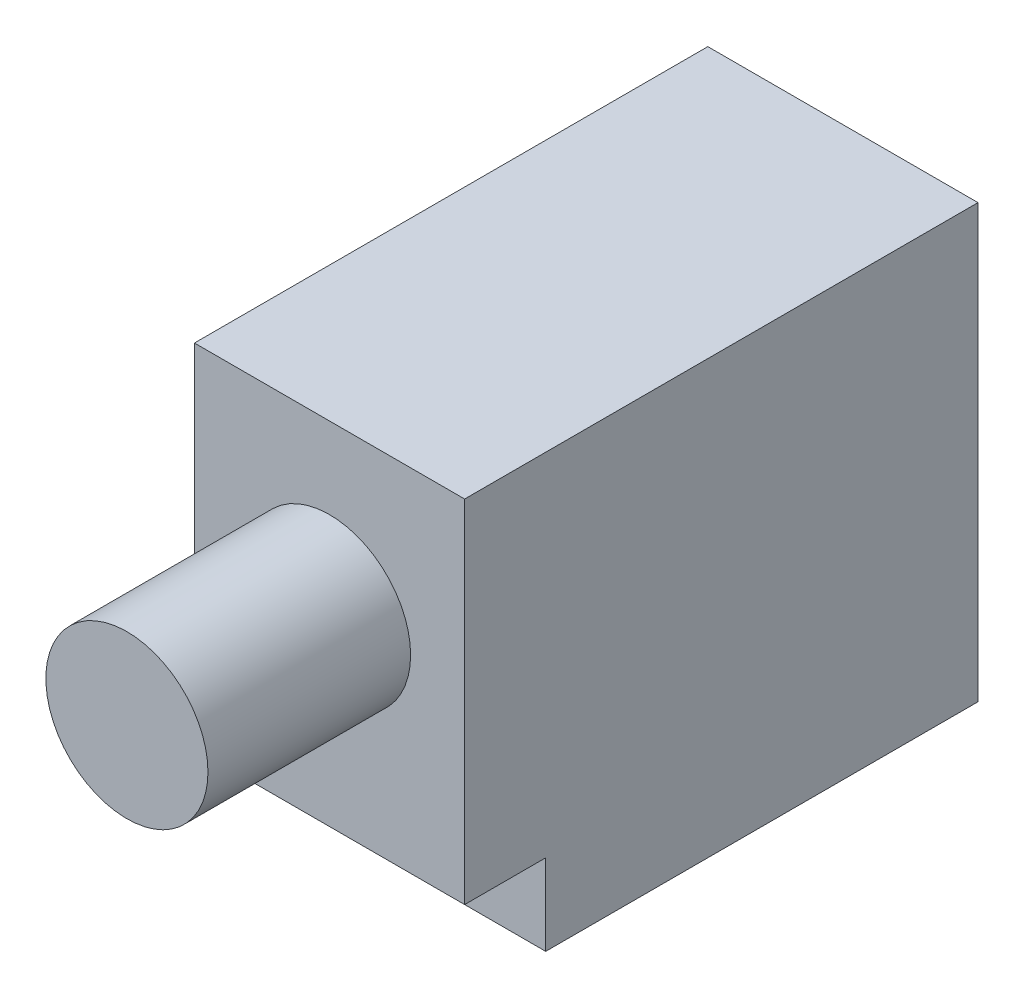
ISO-10303-21;
HEADER;
FILE_DESCRIPTION(('STEP AP214'),'2;1');
FILE_NAME('part.step','',(''),(''),'','','');
FILE_SCHEMA(('AUTOMOTIVE_DESIGN { 1 0 10303 214 1 1 1 1 }'));
ENDSEC;
DATA;
#1=APPLICATION_CONTEXT('core data for automotive mechanical design processes');
#2=APPLICATION_PROTOCOL_DEFINITION('international standard','automotive_design',2000,#1);
#3=PRODUCT_CONTEXT('',#1,'mechanical');
#4=PRODUCT('Part','Part','',(#3));
#5=PRODUCT_RELATED_PRODUCT_CATEGORY('part','',(#4));
#6=PRODUCT_DEFINITION_FORMATION('','',#4);
#7=PRODUCT_DEFINITION_CONTEXT('part definition',#1,'design');
#8=PRODUCT_DEFINITION('design','',#6,#7);
#9=PRODUCT_DEFINITION_SHAPE('','',#8);
#10=(LENGTH_UNIT() NAMED_UNIT(*) SI_UNIT(.MILLI.,.METRE.));
#11=(NAMED_UNIT(*) PLANE_ANGLE_UNIT() SI_UNIT($,.RADIAN.));
#12=(NAMED_UNIT(*) SI_UNIT($,.STERADIAN.) SOLID_ANGLE_UNIT());
#13=UNCERTAINTY_MEASURE_WITH_UNIT(LENGTH_MEASURE(1.E-05),#10,'distance_accuracy_value','');
#14=(GEOMETRIC_REPRESENTATION_CONTEXT(3) GLOBAL_UNCERTAINTY_ASSIGNED_CONTEXT((#13)) GLOBAL_UNIT_ASSIGNED_CONTEXT((#10,
#11,#12)) REPRESENTATION_CONTEXT('',''));
#15=CARTESIAN_POINT('',(0.,0.,0.));
#16=DIRECTION('',(0.,0.,1.));
#17=DIRECTION('',(1.,0.,0.));
#18=AXIS2_PLACEMENT_3D('',#15,#16,#17);
#19=CARTESIAN_POINT('',(15.875,12.7,-15.08125));
#20=DIRECTION('',(0.,0.,1.));
#21=DIRECTION('',(0.,-1.,0.));
#22=AXIS2_PLACEMENT_3D('',#19,#20,#21);
#23=PLANE('',#22);
#24=DIRECTION('',(0.,1.,0.));
#25=VECTOR('',#24,1.);
#26=CARTESIAN_POINT('',(0.,12.7,-15.08125));
#27=LINE('',#26,#25);
#28=CARTESIAN_POINT('',(0.,-12.7,-15.08125));
#29=VERTEX_POINT('',#28);
#30=CARTESIAN_POINT('',(0.,12.7,-15.08125));
#31=VERTEX_POINT('',#30);
#32=EDGE_CURVE('E113',#29,#31,#27,.T.);
#33=ORIENTED_EDGE('',*,*,#32,.T.);
#34=DIRECTION('',(-1.,0.,0.));
#35=VECTOR('',#34,1.);
#36=CARTESIAN_POINT('',(15.875,12.7,-15.08125));
#37=LINE('',#36,#35);
#38=CARTESIAN_POINT('',(15.875,12.7,-15.08125));
#39=VERTEX_POINT('',#38);
#40=EDGE_CURVE('E40',#39,#31,#37,.T.);
#41=ORIENTED_EDGE('',*,*,#40,.F.);
#42=DIRECTION('',(0.,1.,0.));
#43=VECTOR('',#42,1.);
#44=CARTESIAN_POINT('',(15.875,12.7,-15.08125));
#45=LINE('',#44,#43);
#46=CARTESIAN_POINT('',(15.875,-12.7,-15.08125));
#47=VERTEX_POINT('',#46);
#48=EDGE_CURVE('E114',#47,#39,#45,.T.);
#49=ORIENTED_EDGE('',*,*,#48,.F.);
#50=DIRECTION('',(-1.,0.,0.));
#51=VECTOR('',#50,1.);
#52=CARTESIAN_POINT('',(15.875,-12.7,-15.08125));
#53=LINE('',#52,#51);
#54=EDGE_CURVE('E123',#47,#29,#53,.T.);
#55=ORIENTED_EDGE('',*,*,#54,.T.);
#56=EDGE_LOOP('',(#33,#41,#49,#55));
#57=FACE_BOUND('',#56,.T.);
#58=ADVANCED_FACE('F37',(#57),#23,.F.);
#59=CARTESIAN_POINT('',(15.875,12.7,15.08125));
#60=DIRECTION('',(0.,-1.,0.));
#61=DIRECTION('',(0.,0.,-1.));
#62=AXIS2_PLACEMENT_3D('',#59,#60,#61);
#63=PLANE('',#62);
#64=DIRECTION('',(0.,0.,1.));
#65=VECTOR('',#64,1.);
#66=CARTESIAN_POINT('',(0.,12.7,15.08125));
#67=LINE('',#66,#65);
#68=CARTESIAN_POINT('',(0.,12.7,15.08125));
#69=VERTEX_POINT('',#68);
#70=EDGE_CURVE('E119',#31,#69,#67,.T.);
#71=ORIENTED_EDGE('',*,*,#70,.T.);
#72=DIRECTION('',(-1.,0.,0.));
#73=VECTOR('',#72,1.);
#74=CARTESIAN_POINT('',(15.875,12.7,15.08125));
#75=LINE('',#74,#73);
#76=CARTESIAN_POINT('',(15.875,12.7,15.08125));
#77=VERTEX_POINT('',#76);
#78=EDGE_CURVE('E124',#77,#69,#75,.T.);
#79=ORIENTED_EDGE('',*,*,#78,.F.);
#80=DIRECTION('',(0.,0.,1.));
#81=VECTOR('',#80,1.);
#82=CARTESIAN_POINT('',(15.875,12.7,15.08125));
#83=LINE('',#82,#81);
#84=EDGE_CURVE('E85',#39,#77,#83,.T.);
#85=ORIENTED_EDGE('',*,*,#84,.F.);
#86=ORIENTED_EDGE('',*,*,#40,.T.);
#87=EDGE_LOOP('',(#71,#79,#85,#86));
#88=FACE_BOUND('',#87,.T.);
#89=ADVANCED_FACE('F130',(#88),#63,.F.);
#90=CARTESIAN_POINT('',(15.875,12.7,15.08125));
#91=DIRECTION('',(0.,0.,-1.));
#92=DIRECTION('',(0.,1.,0.));
#93=AXIS2_PLACEMENT_3D('',#90,#91,#92);
#94=PLANE('',#93);
#95=CARTESIAN_POINT('',(7.9375,3.175,15.08125));
#96=DIRECTION('',(0.,0.,1.));
#97=DIRECTION('',(1.,0.,0.));
#98=AXIS2_PLACEMENT_3D('',#95,#96,#97);
#99=CIRCLE('',#98,4.7625);
#100=CARTESIAN_POINT('',(12.7,3.175,15.08125));
#101=VERTEX_POINT('',#100);
#102=EDGE_CURVE('E11',#101,#101,#99,.T.);
#103=ORIENTED_EDGE('',*,*,#102,.F.);
#104=EDGE_LOOP('',(#103));
#105=FACE_BOUND('',#104,.T.);
#106=DIRECTION('',(0.,-1.,0.));
#107=VECTOR('',#106,1.);
#108=CARTESIAN_POINT('',(0.,12.7,15.08125));
#109=LINE('',#108,#107);
#110=CARTESIAN_POINT('',(0.,-7.9375,15.08125));
#111=VERTEX_POINT('',#110);
#112=EDGE_CURVE('E115',#69,#111,#109,.T.);
#113=ORIENTED_EDGE('',*,*,#112,.T.);
#114=DIRECTION('',(1.,0.,0.));
#115=VECTOR('',#114,1.);
#116=CARTESIAN_POINT('',(0.,-7.9375,15.08125));
#117=LINE('',#116,#115);
#118=CARTESIAN_POINT('',(15.875,-7.9375,15.08125));
#119=VERTEX_POINT('',#118);
#120=EDGE_CURVE('E136',#111,#119,#117,.T.);
#121=ORIENTED_EDGE('',*,*,#120,.T.);
#122=DIRECTION('',(0.,-1.,0.));
#123=VECTOR('',#122,1.);
#124=CARTESIAN_POINT('',(15.875,12.7,15.08125));
#125=LINE('',#124,#123);
#126=EDGE_CURVE('E140',#77,#119,#125,.T.);
#127=ORIENTED_EDGE('',*,*,#126,.F.);
#128=ORIENTED_EDGE('',*,*,#78,.T.);
#129=EDGE_LOOP('',(#113,#121,#127,#128));
#130=FACE_BOUND('',#129,.T.);
#131=ADVANCED_FACE('F150',(#105,#130),#94,.F.);
#132=CARTESIAN_POINT('',(15.875,-12.7,15.08125));
#133=DIRECTION('',(0.,1.,0.));
#134=DIRECTION('',(0.,0.,1.));
#135=AXIS2_PLACEMENT_3D('',#132,#133,#134);
#136=PLANE('',#135);
#137=DIRECTION('',(0.,0.,-1.));
#138=VECTOR('',#137,1.);
#139=CARTESIAN_POINT('',(15.875,-12.7,15.08125));
#140=LINE('',#139,#138);
#141=CARTESIAN_POINT('',(15.875,-12.7,10.31875));
#142=VERTEX_POINT('',#141);
#143=EDGE_CURVE('E61',#142,#47,#140,.T.);
#144=ORIENTED_EDGE('',*,*,#143,.F.);
#145=DIRECTION('',(1.,0.,0.));
#146=VECTOR('',#145,1.);
#147=CARTESIAN_POINT('',(0.,-12.7,10.31875));
#148=LINE('',#147,#146);
#149=CARTESIAN_POINT('',(0.,-12.7,10.31875));
#150=VERTEX_POINT('',#149);
#151=EDGE_CURVE('E103',#150,#142,#148,.T.);
#152=ORIENTED_EDGE('',*,*,#151,.F.);
#153=DIRECTION('',(0.,0.,-1.));
#154=VECTOR('',#153,1.);
#155=CARTESIAN_POINT('',(0.,-12.7,15.08125));
#156=LINE('',#155,#154);
#157=EDGE_CURVE('E79',#150,#29,#156,.T.);
#158=ORIENTED_EDGE('',*,*,#157,.T.);
#159=ORIENTED_EDGE('',*,*,#54,.F.);
#160=EDGE_LOOP('',(#144,#152,#158,#159));
#161=FACE_BOUND('',#160,.T.);
#162=ADVANCED_FACE('F108',(#161),#136,.F.);
#163=CARTESIAN_POINT('',(15.875,0.,0.));
#164=DIRECTION('',(1.,0.,0.));
#165=DIRECTION('',(0.,0.,-1.));
#166=AXIS2_PLACEMENT_3D('',#163,#164,#165);
#167=PLANE('',#166);
#168=DIRECTION('',(0.,0.,1.));
#169=VECTOR('',#168,1.);
#170=CARTESIAN_POINT('',(15.875,-7.9375,15.08125));
#171=LINE('',#170,#169);
#172=CARTESIAN_POINT('',(15.875,-7.9375,10.31875));
#173=VERTEX_POINT('',#172);
#174=EDGE_CURVE('E106',#173,#119,#171,.T.);
#175=ORIENTED_EDGE('',*,*,#174,.F.);
#176=DIRECTION('',(0.,1.,0.));
#177=VECTOR('',#176,1.);
#178=CARTESIAN_POINT('',(15.875,-12.7,10.31875));
#179=LINE('',#178,#177);
#180=EDGE_CURVE('E148',#142,#173,#179,.T.);
#181=ORIENTED_EDGE('',*,*,#180,.F.);
#182=ORIENTED_EDGE('',*,*,#143,.T.);
#183=ORIENTED_EDGE('',*,*,#48,.T.);
#184=ORIENTED_EDGE('',*,*,#84,.T.);
#185=ORIENTED_EDGE('',*,*,#126,.T.);
#186=EDGE_LOOP('',(#175,#181,#182,#183,#184,#185));
#187=FACE_BOUND('',#186,.T.);
#188=ADVANCED_FACE('F152',(#187),#167,.T.);
#189=CARTESIAN_POINT('',(0.,0.,0.));
#190=DIRECTION('',(1.,0.,0.));
#191=DIRECTION('',(0.,0.,-1.));
#192=AXIS2_PLACEMENT_3D('',#189,#190,#191);
#193=PLANE('',#192);
#194=DIRECTION('',(0.,1.,0.));
#195=VECTOR('',#194,1.);
#196=CARTESIAN_POINT('',(0.,-12.7,10.31875));
#197=LINE('',#196,#195);
#198=CARTESIAN_POINT('',(0.,-7.9375,10.31875));
#199=VERTEX_POINT('',#198);
#200=EDGE_CURVE('E100',#150,#199,#197,.T.);
#201=ORIENTED_EDGE('',*,*,#200,.T.);
#202=DIRECTION('',(0.,0.,1.));
#203=VECTOR('',#202,1.);
#204=CARTESIAN_POINT('',(0.,-7.9375,15.08125));
#205=LINE('',#204,#203);
#206=EDGE_CURVE('E52',#199,#111,#205,.T.);
#207=ORIENTED_EDGE('',*,*,#206,.T.);
#208=ORIENTED_EDGE('',*,*,#112,.F.);
#209=ORIENTED_EDGE('',*,*,#70,.F.);
#210=ORIENTED_EDGE('',*,*,#32,.F.);
#211=ORIENTED_EDGE('',*,*,#157,.F.);
#212=EDGE_LOOP('',(#201,#207,#208,#209,#210,#211));
#213=FACE_BOUND('',#212,.T.);
#214=ADVANCED_FACE('F111',(#213),#193,.F.);
#215=CARTESIAN_POINT('',(7.9375,3.175,26.9875));
#216=DIRECTION('',(0.,0.,-1.));
#217=DIRECTION('',(-1.,0.,0.));
#218=AXIS2_PLACEMENT_3D('',#215,#216,#217);
#219=CYLINDRICAL_SURFACE('',#218,4.7625);
#220=CARTESIAN_POINT('',(7.9375,3.175,26.9875));
#221=DIRECTION('',(0.,0.,1.));
#222=DIRECTION('',(1.,0.,0.));
#223=AXIS2_PLACEMENT_3D('',#220,#221,#222);
#224=CIRCLE('',#223,4.7625);
#225=CARTESIAN_POINT('',(12.7,3.175,26.9875));
#226=VERTEX_POINT('',#225);
#227=EDGE_CURVE('E133',#226,#226,#224,.T.);
#228=ORIENTED_EDGE('',*,*,#227,.F.);
#229=EDGE_LOOP('',(#228));
#230=FACE_BOUND('',#229,.T.);
#231=ORIENTED_EDGE('',*,*,#102,.T.);
#232=EDGE_LOOP('',(#231));
#233=FACE_BOUND('',#232,.T.);
#234=ADVANCED_FACE('F163',(#230,#233),#219,.T.);
#235=CARTESIAN_POINT('',(7.9375,3.175,26.9875));
#236=DIRECTION('',(0.,0.,1.));
#237=DIRECTION('',(1.,0.,0.));
#238=AXIS2_PLACEMENT_3D('',#235,#236,#237);
#239=PLANE('',#238);
#240=ORIENTED_EDGE('',*,*,#227,.T.);
#241=EDGE_LOOP('',(#240));
#242=FACE_BOUND('',#241,.T.);
#243=ADVANCED_FACE('F155',(#242),#239,.T.);
#244=CARTESIAN_POINT('',(0.,-7.9375,15.08125));
#245=DIRECTION('',(0.,1.,0.));
#246=DIRECTION('',(0.,0.,1.));
#247=AXIS2_PLACEMENT_3D('',#244,#245,#246);
#248=PLANE('',#247);
#249=ORIENTED_EDGE('',*,*,#174,.T.);
#250=ORIENTED_EDGE('',*,*,#120,.F.);
#251=ORIENTED_EDGE('',*,*,#206,.F.);
#252=DIRECTION('',(1.,0.,0.));
#253=VECTOR('',#252,1.);
#254=CARTESIAN_POINT('',(0.,-7.9375,10.31875));
#255=LINE('',#254,#253);
#256=EDGE_CURVE('E104',#199,#173,#255,.T.);
#257=ORIENTED_EDGE('',*,*,#256,.T.);
#258=EDGE_LOOP('',(#249,#250,#251,#257));
#259=FACE_BOUND('',#258,.T.);
#260=ADVANCED_FACE('F153',(#259),#248,.F.);
#261=CARTESIAN_POINT('',(0.,-12.7,10.31875));
#262=DIRECTION('',(0.,0.,-1.));
#263=DIRECTION('',(-1.,0.,0.));
#264=AXIS2_PLACEMENT_3D('',#261,#262,#263);
#265=PLANE('',#264);
#266=ORIENTED_EDGE('',*,*,#180,.T.);
#267=ORIENTED_EDGE('',*,*,#256,.F.);
#268=ORIENTED_EDGE('',*,*,#200,.F.);
#269=ORIENTED_EDGE('',*,*,#151,.T.);
#270=EDGE_LOOP('',(#266,#267,#268,#269));
#271=FACE_BOUND('',#270,.T.);
#272=ADVANCED_FACE('F102',(#271),#265,.F.);
#273=CLOSED_SHELL('',(#58,#89,#131,#162,#188,#214,#234,#243,#260,#272));
#274=MANIFOLD_SOLID_BREP('B2',#273);
#275=ADVANCED_BREP_SHAPE_REPRESENTATION('',(#18,#274),#14);
#276=SHAPE_DEFINITION_REPRESENTATION(#9,#275);
ENDSEC;
END-ISO-10303-21;
